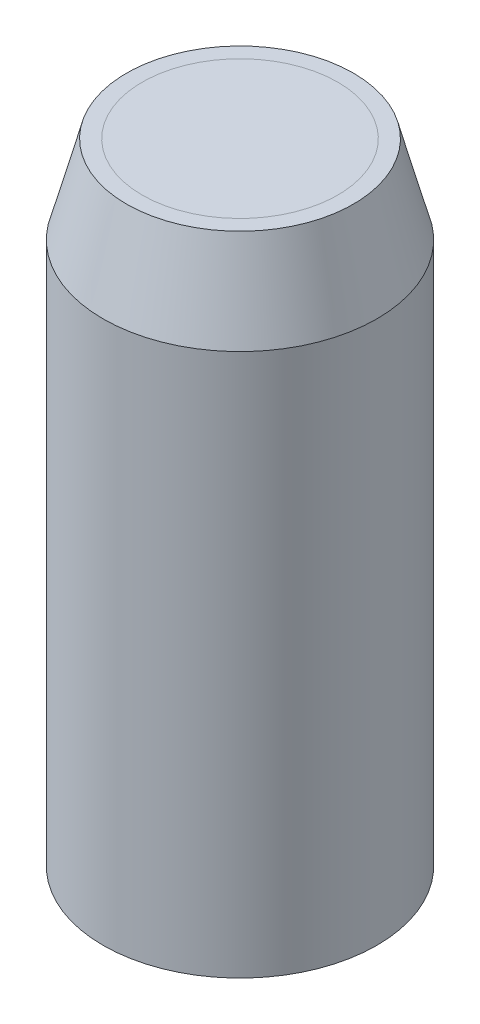
ISO-10303-21;
HEADER;
FILE_DESCRIPTION(('STEP AP214'),'2;1');
FILE_NAME('part.step','',(''),(''),'','','');
FILE_SCHEMA(('AUTOMOTIVE_DESIGN { 1 0 10303 214 1 1 1 1 }'));
ENDSEC;
DATA;
#1=APPLICATION_CONTEXT('core data for automotive mechanical design processes');
#2=APPLICATION_PROTOCOL_DEFINITION('international standard','automotive_design',2000,#1);
#3=PRODUCT_CONTEXT('',#1,'mechanical');
#4=PRODUCT('Part','Part','',(#3));
#5=PRODUCT_RELATED_PRODUCT_CATEGORY('part','',(#4));
#6=PRODUCT_DEFINITION_FORMATION('','',#4);
#7=PRODUCT_DEFINITION_CONTEXT('part definition',#1,'design');
#8=PRODUCT_DEFINITION('design','',#6,#7);
#9=PRODUCT_DEFINITION_SHAPE('','',#8);
#10=(LENGTH_UNIT() NAMED_UNIT(*) SI_UNIT(.MILLI.,.METRE.));
#11=(NAMED_UNIT(*) PLANE_ANGLE_UNIT() SI_UNIT($,.RADIAN.));
#12=(NAMED_UNIT(*) SI_UNIT($,.STERADIAN.) SOLID_ANGLE_UNIT());
#13=UNCERTAINTY_MEASURE_WITH_UNIT(LENGTH_MEASURE(1.E-05),#10,'distance_accuracy_value','');
#14=(GEOMETRIC_REPRESENTATION_CONTEXT(3) GLOBAL_UNCERTAINTY_ASSIGNED_CONTEXT((#13)) GLOBAL_UNIT_ASSIGNED_CONTEXT((#10,
#11,#12)) REPRESENTATION_CONTEXT('',''));
#15=CARTESIAN_POINT('',(0.,0.,0.));
#16=DIRECTION('',(0.,0.,1.));
#17=DIRECTION('',(1.,0.,0.));
#18=AXIS2_PLACEMENT_3D('',#15,#16,#17);
#19=CARTESIAN_POINT('',(0.,0.,0.));
#20=DIRECTION('',(0.,-1.,0.));
#21=DIRECTION('',(0.,0.,-1.));
#22=AXIS2_PLACEMENT_3D('',#19,#20,#21);
#23=PLANE('',#22);
#24=CARTESIAN_POINT('',(0.,0.,0.));
#25=DIRECTION('',(0.,-1.,0.));
#26=DIRECTION('',(0.,0.,-1.));
#27=AXIS2_PLACEMENT_3D('',#24,#25,#26);
#28=CIRCLE('',#27,5.);
#29=CARTESIAN_POINT('',(0.,0.,-5.));
#30=VERTEX_POINT('',#29);
#31=EDGE_CURVE('E11',#30,#30,#28,.T.);
#32=ORIENTED_EDGE('',*,*,#31,.F.);
#33=EDGE_LOOP('',(#32));
#34=FACE_BOUND('',#33,.T.);
#35=ADVANCED_FACE('F53',(#34),#23,.F.);
#36=CARTESIAN_POINT('',(0.,0.,0.));
#37=DIRECTION('',(0.,-1.,0.));
#38=DIRECTION('',(0.,0.,-1.));
#39=AXIS2_PLACEMENT_3D('',#36,#37,#38);
#40=CYLINDRICAL_SURFACE('',#39,5.);
#41=CARTESIAN_POINT('',(0.,29.8117400896407,0.));
#42=DIRECTION('',(0.,-1.,0.));
#43=DIRECTION('',(0.,0.,-1.));
#44=AXIS2_PLACEMENT_3D('',#41,#42,#43);
#45=CIRCLE('',#44,5.);
#46=CARTESIAN_POINT('',(0.,29.8117400896407,-5.));
#47=VERTEX_POINT('',#46);
#48=EDGE_CURVE('E60',#47,#47,#45,.T.);
#49=ORIENTED_EDGE('',*,*,#48,.F.);
#50=EDGE_LOOP('',(#49));
#51=FACE_BOUND('',#50,.T.);
#52=ORIENTED_EDGE('',*,*,#31,.T.);
#53=EDGE_LOOP('',(#52));
#54=FACE_BOUND('',#53,.T.);
#55=ADVANCED_FACE('F97',(#51,#54),#40,.F.);
#56=CARTESIAN_POINT('',(-5.,29.8117400896407,0.));
#57=DIRECTION('',(0.,-1.,0.));
#58=DIRECTION('',(0.,0.,-1.));
#59=AXIS2_PLACEMENT_3D('',#56,#57,#58);
#60=PLANE('',#59);
#61=CARTESIAN_POINT('',(0.,29.8117400896407,0.));
#62=DIRECTION('',(0.,-1.,0.));
#63=DIRECTION('',(0.,0.,-1.));
#64=AXIS2_PLACEMENT_3D('',#61,#62,#63);
#65=CIRCLE('',#64,5.8);
#66=CARTESIAN_POINT('',(0.,29.8117400896407,-5.8));
#67=VERTEX_POINT('',#66);
#68=EDGE_CURVE('E65',#67,#67,#65,.T.);
#69=ORIENTED_EDGE('',*,*,#68,.F.);
#70=EDGE_LOOP('',(#69));
#71=FACE_BOUND('',#70,.T.);
#72=ORIENTED_EDGE('',*,*,#48,.T.);
#73=EDGE_LOOP('',(#72));
#74=FACE_BOUND('',#73,.T.);
#75=ADVANCED_FACE('F92',(#71,#74),#60,.F.);
#76=CARTESIAN_POINT('',(0.,29.8117400896407,0.));
#77=DIRECTION('',(0.,-1.,0.));
#78=DIRECTION('',(0.,0.,-1.));
#79=AXIS2_PLACEMENT_3D('',#76,#77,#78);
#80=CONICAL_SURFACE('',#79,5.8,0.26179938779915);
#81=CARTESIAN_POINT('',(0.,25.3332791205581,0.));
#82=DIRECTION('',(0.,-1.,0.));
#83=DIRECTION('',(0.,0.,-1.));
#84=AXIS2_PLACEMENT_3D('',#81,#82,#83);
#85=CIRCLE('',#84,7.);
#86=CARTESIAN_POINT('',(0.,25.3332791205581,-7.));
#87=VERTEX_POINT('',#86);
#88=EDGE_CURVE('E70',#87,#87,#85,.T.);
#89=ORIENTED_EDGE('',*,*,#88,.F.);
#90=EDGE_LOOP('',(#89));
#91=FACE_BOUND('',#90,.T.);
#92=ORIENTED_EDGE('',*,*,#68,.T.);
#93=EDGE_LOOP('',(#92));
#94=FACE_BOUND('',#93,.T.);
#95=ADVANCED_FACE('F86',(#91,#94),#80,.T.);
#96=CARTESIAN_POINT('',(0.,0.,0.));
#97=DIRECTION('',(0.,-1.,0.));
#98=DIRECTION('',(0.,0.,-1.));
#99=AXIS2_PLACEMENT_3D('',#96,#97,#98);
#100=CYLINDRICAL_SURFACE('',#99,7.);
#101=CARTESIAN_POINT('',(0.,-2.4,0.));
#102=DIRECTION('',(0.,-1.,0.));
#103=DIRECTION('',(0.,0.,-1.));
#104=AXIS2_PLACEMENT_3D('',#101,#102,#103);
#105=CIRCLE('',#104,7.);
#106=CARTESIAN_POINT('',(0.,-2.4,-7.));
#107=VERTEX_POINT('',#106);
#108=EDGE_CURVE('E76',#107,#107,#105,.T.);
#109=ORIENTED_EDGE('',*,*,#108,.F.);
#110=EDGE_LOOP('',(#109));
#111=FACE_BOUND('',#110,.T.);
#112=ORIENTED_EDGE('',*,*,#88,.T.);
#113=EDGE_LOOP('',(#112));
#114=FACE_BOUND('',#113,.T.);
#115=ADVANCED_FACE('F83',(#111,#114),#100,.T.);
#116=CARTESIAN_POINT('',(-7.,-2.4,0.));
#117=DIRECTION('',(0.,1.,0.));
#118=DIRECTION('',(0.,0.,1.));
#119=AXIS2_PLACEMENT_3D('',#116,#117,#118);
#120=PLANE('',#119);
#121=ORIENTED_EDGE('',*,*,#108,.T.);
#122=EDGE_LOOP('',(#121));
#123=FACE_BOUND('',#122,.T.);
#124=ADVANCED_FACE('F81',(#123),#120,.F.);
#125=CLOSED_SHELL('',(#35,#55,#75,#95,#115,#124));
#126=MANIFOLD_SOLID_BREP('B2',#125);
#127=CARTESIAN_POINT('',(0.,29.8117400896407,0.));
#128=DIRECTION('',(0.,-1.,0.));
#129=DIRECTION('',(0.,0.,-1.));
#130=AXIS2_PLACEMENT_3D('',#127,#128,#129);
#131=CYLINDRICAL_SURFACE('',#130,5.);
#132=CARTESIAN_POINT('',(0.,29.8117400896407,0.));
#133=DIRECTION('',(0.,1.,0.));
#134=DIRECTION('',(0.,0.,1.));
#135=AXIS2_PLACEMENT_3D('',#132,#133,#134);
#136=CIRCLE('',#135,5.);
#137=CARTESIAN_POINT('',(0.,29.8117400896407,5.));
#138=VERTEX_POINT('',#137);
#139=EDGE_CURVE('E52',#138,#138,#136,.T.);
#140=ORIENTED_EDGE('',*,*,#139,.F.);
#141=EDGE_LOOP('',(#140));
#142=FACE_BOUND('',#141,.T.);
#143=CARTESIAN_POINT('',(0.,0.,0.));
#144=DIRECTION('',(0.,1.,0.));
#145=DIRECTION('',(0.,0.,1.));
#146=AXIS2_PLACEMENT_3D('',#143,#144,#145);
#147=CIRCLE('',#146,5.);
#148=CARTESIAN_POINT('',(0.,0.,5.));
#149=VERTEX_POINT('',#148);
#150=EDGE_CURVE('E171',#149,#149,#147,.T.);
#151=ORIENTED_EDGE('',*,*,#150,.T.);
#152=EDGE_LOOP('',(#151));
#153=FACE_BOUND('',#152,.T.);
#154=ADVANCED_FACE('F168',(#142,#153),#131,.T.);
#155=CARTESIAN_POINT('',(0.,29.8117400896407,0.));
#156=DIRECTION('',(0.,1.,0.));
#157=DIRECTION('',(0.,0.,1.));
#158=AXIS2_PLACEMENT_3D('',#155,#156,#157);
#159=PLANE('',#158);
#160=ORIENTED_EDGE('',*,*,#139,.T.);
#161=EDGE_LOOP('',(#160));
#162=FACE_BOUND('',#161,.T.);
#163=ADVANCED_FACE('F183',(#162),#159,.T.);
#164=CARTESIAN_POINT('',(0.,0.,0.));
#165=DIRECTION('',(0.,1.,0.));
#166=DIRECTION('',(0.,0.,1.));
#167=AXIS2_PLACEMENT_3D('',#164,#165,#166);
#168=PLANE('',#167);
#169=ORIENTED_EDGE('',*,*,#150,.F.);
#170=EDGE_LOOP('',(#169));
#171=FACE_BOUND('',#170,.T.);
#172=ADVANCED_FACE('F181',(#171),#168,.F.);
#173=CLOSED_SHELL('',(#154,#163,#172));
#174=MANIFOLD_SOLID_BREP('B6_NOT_SHOWN',#173);
#175=ADVANCED_BREP_SHAPE_REPRESENTATION('',(#18,#126,#174),#14);
#176=SHAPE_DEFINITION_REPRESENTATION(#9,#175);
ENDSEC;
END-ISO-10303-21;
